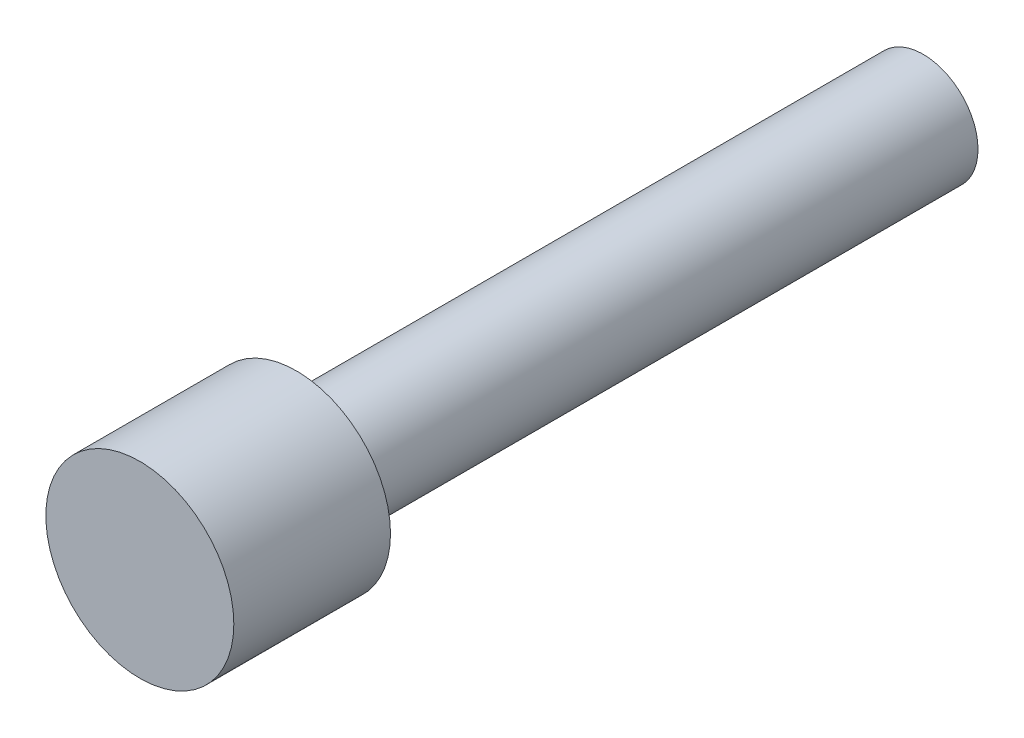
ISO-10303-21;
HEADER;
FILE_DESCRIPTION(('STEP AP214'),'2;1');
FILE_NAME('part.step','',(''),(''),'','','');
FILE_SCHEMA(('AUTOMOTIVE_DESIGN { 1 0 10303 214 1 1 1 1 }'));
ENDSEC;
DATA;
#1=APPLICATION_CONTEXT('core data for automotive mechanical design processes');
#2=APPLICATION_PROTOCOL_DEFINITION('international standard','automotive_design',2000,#1);
#3=PRODUCT_CONTEXT('',#1,'mechanical');
#4=PRODUCT('Part','Part','',(#3));
#5=PRODUCT_RELATED_PRODUCT_CATEGORY('part','',(#4));
#6=PRODUCT_DEFINITION_FORMATION('','',#4);
#7=PRODUCT_DEFINITION_CONTEXT('part definition',#1,'design');
#8=PRODUCT_DEFINITION('design','',#6,#7);
#9=PRODUCT_DEFINITION_SHAPE('','',#8);
#10=(LENGTH_UNIT() NAMED_UNIT(*) SI_UNIT(.MILLI.,.METRE.));
#11=(NAMED_UNIT(*) PLANE_ANGLE_UNIT() SI_UNIT($,.RADIAN.));
#12=(NAMED_UNIT(*) SI_UNIT($,.STERADIAN.) SOLID_ANGLE_UNIT());
#13=UNCERTAINTY_MEASURE_WITH_UNIT(LENGTH_MEASURE(1.E-05),#10,'distance_accuracy_value','');
#14=(GEOMETRIC_REPRESENTATION_CONTEXT(3) GLOBAL_UNCERTAINTY_ASSIGNED_CONTEXT((#13)) GLOBAL_UNIT_ASSIGNED_CONTEXT((#10,
#11,#12)) REPRESENTATION_CONTEXT('',''));
#15=CARTESIAN_POINT('',(0.,0.,0.));
#16=DIRECTION('',(0.,0.,1.));
#17=DIRECTION('',(1.,0.,0.));
#18=AXIS2_PLACEMENT_3D('',#15,#16,#17);
#19=CARTESIAN_POINT('',(117.212598601267,333.982219224967,20.));
#20=DIRECTION('',(0.,0.,-1.));
#21=DIRECTION('',(-1.,0.,0.));
#22=AXIS2_PLACEMENT_3D('',#19,#20,#21);
#23=CYLINDRICAL_SURFACE('',#22,1.75);
#24=CARTESIAN_POINT('',(117.212598601267,333.982219224967,20.));
#25=DIRECTION('',(0.,0.,1.));
#26=DIRECTION('',(1.,0.,0.));
#27=AXIS2_PLACEMENT_3D('',#24,#25,#26);
#28=CIRCLE('',#27,1.75);
#29=CARTESIAN_POINT('',(118.962598601267,333.982219224967,20.));
#30=VERTEX_POINT('',#29);
#31=EDGE_CURVE('E10',#30,#30,#28,.T.);
#32=ORIENTED_EDGE('',*,*,#31,.F.);
#33=EDGE_LOOP('',(#32));
#34=FACE_BOUND('',#33,.T.);
#35=CARTESIAN_POINT('',(117.212598601267,333.982219224967,0.));
#36=DIRECTION('',(0.,0.,1.));
#37=DIRECTION('',(1.,0.,0.));
#38=AXIS2_PLACEMENT_3D('',#35,#36,#37);
#39=CIRCLE('',#38,1.75);
#40=CARTESIAN_POINT('',(118.962598601267,333.982219224967,0.));
#41=VERTEX_POINT('',#40);
#42=EDGE_CURVE('E40',#41,#41,#39,.T.);
#43=ORIENTED_EDGE('',*,*,#42,.T.);
#44=EDGE_LOOP('',(#43));
#45=FACE_BOUND('',#44,.T.);
#46=ADVANCED_FACE('F37',(#34,#45),#23,.T.);
#47=CARTESIAN_POINT('',(117.212598601267,333.982219224967,0.));
#48=DIRECTION('',(0.,0.,1.));
#49=DIRECTION('',(1.,0.,0.));
#50=AXIS2_PLACEMENT_3D('',#47,#48,#49);
#51=PLANE('',#50);
#52=ORIENTED_EDGE('',*,*,#42,.F.);
#53=EDGE_LOOP('',(#52));
#54=FACE_BOUND('',#53,.T.);
#55=ADVANCED_FACE('F64',(#54),#51,.F.);
#56=CARTESIAN_POINT('',(117.212598601267,333.982219224967,25.));
#57=DIRECTION('',(0.,0.,-1.));
#58=DIRECTION('',(-1.,0.,0.));
#59=AXIS2_PLACEMENT_3D('',#56,#57,#58);
#60=CYLINDRICAL_SURFACE('',#59,3.00000000000001);
#61=CARTESIAN_POINT('',(117.212598601267,333.982219224967,25.));
#62=DIRECTION('',(0.,0.,1.));
#63=DIRECTION('',(1.,0.,0.));
#64=AXIS2_PLACEMENT_3D('',#61,#62,#63);
#65=CIRCLE('',#64,3.00000000000001);
#66=CARTESIAN_POINT('',(120.212598601267,333.982219224967,25.));
#67=VERTEX_POINT('',#66);
#68=EDGE_CURVE('E49',#67,#67,#65,.T.);
#69=ORIENTED_EDGE('',*,*,#68,.F.);
#70=EDGE_LOOP('',(#69));
#71=FACE_BOUND('',#70,.T.);
#72=CARTESIAN_POINT('',(117.212598601267,333.982219224967,20.));
#73=DIRECTION('',(0.,0.,1.));
#74=DIRECTION('',(1.,0.,0.));
#75=AXIS2_PLACEMENT_3D('',#72,#73,#74);
#76=CIRCLE('',#75,3.00000000000001);
#77=CARTESIAN_POINT('',(120.212598601267,333.982219224967,20.));
#78=VERTEX_POINT('',#77);
#79=EDGE_CURVE('E51',#78,#78,#76,.T.);
#80=ORIENTED_EDGE('',*,*,#79,.T.);
#81=EDGE_LOOP('',(#80));
#82=FACE_BOUND('',#81,.T.);
#83=ADVANCED_FACE('F61',(#71,#82),#60,.T.);
#84=CARTESIAN_POINT('',(117.212598601267,333.982219224967,25.));
#85=DIRECTION('',(0.,0.,1.));
#86=DIRECTION('',(1.,0.,0.));
#87=AXIS2_PLACEMENT_3D('',#84,#85,#86);
#88=PLANE('',#87);
#89=ORIENTED_EDGE('',*,*,#68,.T.);
#90=EDGE_LOOP('',(#89));
#91=FACE_BOUND('',#90,.T.);
#92=ADVANCED_FACE('F59',(#91),#88,.T.);
#93=CARTESIAN_POINT('',(117.212598601267,333.982219224967,20.));
#94=DIRECTION('',(0.,0.,1.));
#95=DIRECTION('',(1.,0.,0.));
#96=AXIS2_PLACEMENT_3D('',#93,#94,#95);
#97=PLANE('',#96);
#98=ORIENTED_EDGE('',*,*,#31,.T.);
#99=EDGE_LOOP('',(#98));
#100=FACE_BOUND('',#99,.T.);
#101=ORIENTED_EDGE('',*,*,#79,.F.);
#102=EDGE_LOOP('',(#101));
#103=FACE_BOUND('',#102,.T.);
#104=ADVANCED_FACE('F68',(#100,#103),#97,.F.);
#105=CLOSED_SHELL('',(#46,#55,#83,#92,#104));
#106=MANIFOLD_SOLID_BREP('B2',#105);
#107=ADVANCED_BREP_SHAPE_REPRESENTATION('',(#18,#106),#14);
#108=SHAPE_DEFINITION_REPRESENTATION(#9,#107);
ENDSEC;
END-ISO-10303-21;
